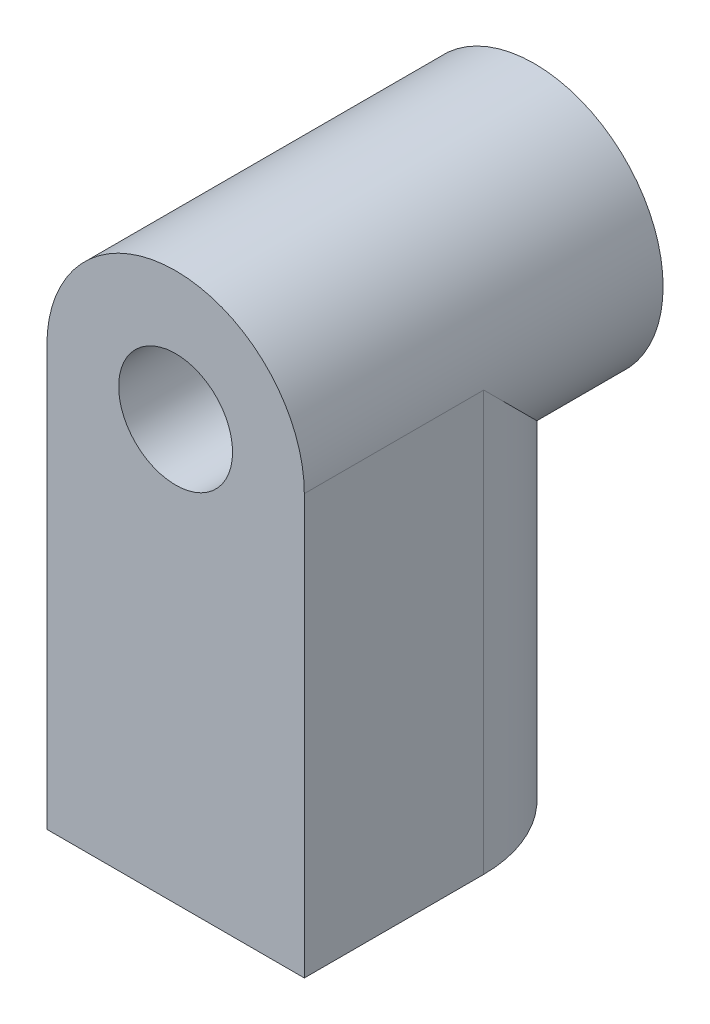
ISO-10303-21;
HEADER;
FILE_DESCRIPTION(('STEP AP214'),'2;1');
FILE_NAME('part.step','',(''),(''),'','','');
FILE_SCHEMA(('AUTOMOTIVE_DESIGN { 1 0 10303 214 1 1 1 1 }'));
ENDSEC;
DATA;
#1=APPLICATION_CONTEXT('core data for automotive mechanical design processes');
#2=APPLICATION_PROTOCOL_DEFINITION('international standard','automotive_design',2000,#1);
#3=PRODUCT_CONTEXT('',#1,'mechanical');
#4=PRODUCT('Part','Part','',(#3));
#5=PRODUCT_RELATED_PRODUCT_CATEGORY('part','',(#4));
#6=PRODUCT_DEFINITION_FORMATION('','',#4);
#7=PRODUCT_DEFINITION_CONTEXT('part definition',#1,'design');
#8=PRODUCT_DEFINITION('design','',#6,#7);
#9=PRODUCT_DEFINITION_SHAPE('','',#8);
#10=(LENGTH_UNIT() NAMED_UNIT(*) SI_UNIT(.MILLI.,.METRE.));
#11=(NAMED_UNIT(*) PLANE_ANGLE_UNIT() SI_UNIT($,.RADIAN.));
#12=(NAMED_UNIT(*) SI_UNIT($,.STERADIAN.) SOLID_ANGLE_UNIT());
#13=UNCERTAINTY_MEASURE_WITH_UNIT(LENGTH_MEASURE(1.E-05),#10,'distance_accuracy_value','');
#14=(GEOMETRIC_REPRESENTATION_CONTEXT(3) GLOBAL_UNCERTAINTY_ASSIGNED_CONTEXT((#13)) GLOBAL_UNIT_ASSIGNED_CONTEXT((#10,
#11,#12)) REPRESENTATION_CONTEXT('',''));
#15=CARTESIAN_POINT('',(0.,0.,0.));
#16=DIRECTION('',(0.,0.,1.));
#17=DIRECTION('',(1.,0.,0.));
#18=AXIS2_PLACEMENT_3D('',#15,#16,#17);
#19=CARTESIAN_POINT('',(0.,0.,10.));
#20=DIRECTION('',(0.,0.,-1.));
#21=DIRECTION('',(-1.,0.,0.));
#22=AXIS2_PLACEMENT_3D('',#19,#20,#21);
#23=CYLINDRICAL_SURFACE('',#22,3.5875);
#24=CARTESIAN_POINT('',(0.,0.,0.));
#25=DIRECTION('',(0.,0.,1.));
#26=DIRECTION('',(1.,0.,0.));
#27=AXIS2_PLACEMENT_3D('',#24,#25,#26);
#28=CIRCLE('',#27,3.5875);
#29=CARTESIAN_POINT('',(3.5875,0.,0.));
#30=VERTEX_POINT('',#29);
#31=EDGE_CURVE('E109',#30,#30,#28,.T.);
#32=ORIENTED_EDGE('',*,*,#31,.T.);
#33=EDGE_LOOP('',(#32));
#34=FACE_BOUND('',#33,.T.);
#35=DIRECTION('',(0.,0.,-1.));
#36=VECTOR('',#35,1.);
#37=CARTESIAN_POINT('',(3.5875,0.,10.));
#38=LINE('',#37,#36);
#39=CARTESIAN_POINT('',(3.5875,0.,5.00000000000002));
#40=VERTEX_POINT('',#39);
#41=CARTESIAN_POINT('',(3.5875,0.,10.));
#42=VERTEX_POINT('',#41);
#43=EDGE_CURVE('E237',#40,#42,#38,.F.);
#44=ORIENTED_EDGE('',*,*,#43,.F.);
#45=CARTESIAN_POINT('',(0.,0.,5.));
#46=DIRECTION('',(0.,0.707106781186547,-0.707106781186547));
#47=DIRECTION('',(0.,-0.707106781186547,-0.707106781186547));
#48=AXIS2_PLACEMENT_3D('',#45,#46,#47);
#49=ELLIPSE('',#48,5.07349115501348,3.5875);
#50=CARTESIAN_POINT('',(-3.5875,0.,5.00000000000002));
#51=VERTEX_POINT('',#50);
#52=EDGE_CURVE('E11',#40,#51,#49,.T.);
#53=ORIENTED_EDGE('',*,*,#52,.T.);
#54=DIRECTION('',(0.,0.,-1.));
#55=VECTOR('',#54,1.);
#56=CARTESIAN_POINT('',(-3.5875,0.,10.));
#57=LINE('',#56,#55);
#58=CARTESIAN_POINT('',(-3.5875,0.,10.));
#59=VERTEX_POINT('',#58);
#60=EDGE_CURVE('E78',#51,#59,#57,.F.);
#61=ORIENTED_EDGE('',*,*,#60,.T.);
#62=CARTESIAN_POINT('',(0.,0.,10.));
#63=DIRECTION('',(0.,0.,1.));
#64=DIRECTION('',(1.,0.,0.));
#65=AXIS2_PLACEMENT_3D('',#62,#63,#64);
#66=CIRCLE('',#65,3.5875);
#67=EDGE_CURVE('E112',#42,#59,#66,.T.);
#68=ORIENTED_EDGE('',*,*,#67,.F.);
#69=EDGE_LOOP('',(#44,#53,#61,#68));
#70=FACE_BOUND('',#69,.T.);
#71=ADVANCED_FACE('F33',(#34,#70),#23,.T.);
#72=CARTESIAN_POINT('',(0.,0.,10.));
#73=DIRECTION('',(0.,0.,1.));
#74=DIRECTION('',(1.,0.,0.));
#75=AXIS2_PLACEMENT_3D('',#72,#73,#74);
#76=PLANE('',#75);
#77=DIRECTION('',(0.,1.,0.));
#78=VECTOR('',#77,1.);
#79=CARTESIAN_POINT('',(3.5875,-11.69195383,10.));
#80=LINE('',#79,#78);
#81=CARTESIAN_POINT('',(3.5875,-11.69195383,10.));
#82=VERTEX_POINT('',#81);
#83=EDGE_CURVE('E54',#82,#42,#80,.T.);
#84=ORIENTED_EDGE('',*,*,#83,.T.);
#85=ORIENTED_EDGE('',*,*,#67,.T.);
#86=DIRECTION('',(0.,1.,0.));
#87=VECTOR('',#86,1.);
#88=CARTESIAN_POINT('',(-3.5875,-11.69195383,10.));
#89=LINE('',#88,#87);
#90=CARTESIAN_POINT('',(-3.5875,-11.69195383,10.));
#91=VERTEX_POINT('',#90);
#92=EDGE_CURVE('E80',#91,#59,#89,.T.);
#93=ORIENTED_EDGE('',*,*,#92,.F.);
#94=DIRECTION('',(1.,0.,0.));
#95=VECTOR('',#94,1.);
#96=CARTESIAN_POINT('',(-3.5875,-11.69195383,10.));
#97=LINE('',#96,#95);
#98=EDGE_CURVE('E90',#91,#82,#97,.T.);
#99=ORIENTED_EDGE('',*,*,#98,.T.);
#100=EDGE_LOOP('',(#84,#85,#93,#99));
#101=FACE_BOUND('',#100,.T.);
#102=CARTESIAN_POINT('',(0.,0.,10.));
#103=DIRECTION('',(0.,0.,1.));
#104=DIRECTION('',(1.,0.,0.));
#105=AXIS2_PLACEMENT_3D('',#102,#103,#104);
#106=CIRCLE('',#105,1.5875);
#107=CARTESIAN_POINT('',(1.5875,0.,10.));
#108=VERTEX_POINT('',#107);
#109=EDGE_CURVE('E106',#108,#108,#106,.T.);
#110=ORIENTED_EDGE('',*,*,#109,.F.);
#111=EDGE_LOOP('',(#110));
#112=FACE_BOUND('',#111,.T.);
#113=ADVANCED_FACE('F141',(#101,#112),#76,.T.);
#114=CARTESIAN_POINT('',(0.,0.,0.));
#115=DIRECTION('',(0.,0.,1.));
#116=DIRECTION('',(1.,0.,0.));
#117=AXIS2_PLACEMENT_3D('',#114,#115,#116);
#118=PLANE('',#117);
#119=ORIENTED_EDGE('',*,*,#31,.F.);
#120=EDGE_LOOP('',(#119));
#121=FACE_BOUND('',#120,.T.);
#122=CARTESIAN_POINT('',(0.,0.,0.));
#123=DIRECTION('',(0.,0.,1.));
#124=DIRECTION('',(1.,0.,0.));
#125=AXIS2_PLACEMENT_3D('',#122,#123,#124);
#126=CIRCLE('',#125,1.5875);
#127=CARTESIAN_POINT('',(1.5875,0.,0.));
#128=VERTEX_POINT('',#127);
#129=EDGE_CURVE('E103',#128,#128,#126,.T.);
#130=ORIENTED_EDGE('',*,*,#129,.T.);
#131=EDGE_LOOP('',(#130));
#132=FACE_BOUND('',#131,.T.);
#133=ADVANCED_FACE('F139',(#121,#132),#118,.F.);
#134=CARTESIAN_POINT('',(0.,0.,10.));
#135=DIRECTION('',(0.,0.,-1.));
#136=DIRECTION('',(-1.,0.,0.));
#137=AXIS2_PLACEMENT_3D('',#134,#135,#136);
#138=CYLINDRICAL_SURFACE('',#137,1.5875);
#139=ORIENTED_EDGE('',*,*,#109,.T.);
#140=EDGE_LOOP('',(#139));
#141=FACE_BOUND('',#140,.T.);
#142=ORIENTED_EDGE('',*,*,#129,.F.);
#143=EDGE_LOOP('',(#142));
#144=FACE_BOUND('',#143,.T.);
#145=ADVANCED_FACE('F136',(#141,#144),#138,.F.);
#146=CARTESIAN_POINT('',(0.,-11.69195383,5.));
#147=DIRECTION('',(0.,1.,0.));
#148=DIRECTION('',(0.,0.,1.));
#149=AXIS2_PLACEMENT_3D('',#146,#147,#148);
#150=CYLINDRICAL_SURFACE('',#149,3.5875);
#151=ORIENTED_EDGE('',*,*,#52,.F.);
#152=DIRECTION('',(0.,1.,0.));
#153=VECTOR('',#152,1.);
#154=CARTESIAN_POINT('',(3.5875,-11.69195383,5.));
#155=LINE('',#154,#153);
#156=CARTESIAN_POINT('',(3.5875,-11.69195383,5.));
#157=VERTEX_POINT('',#156);
#158=EDGE_CURVE('E93',#157,#40,#155,.T.);
#159=ORIENTED_EDGE('',*,*,#158,.F.);
#160=CARTESIAN_POINT('',(0.,-11.69195383,5.));
#161=DIRECTION('',(0.,1.,0.));
#162=DIRECTION('',(0.,0.,1.));
#163=AXIS2_PLACEMENT_3D('',#160,#161,#162);
#164=CIRCLE('',#163,3.5875);
#165=CARTESIAN_POINT('',(-3.5875,-11.69195383,5.));
#166=VERTEX_POINT('',#165);
#167=EDGE_CURVE('E88',#157,#166,#164,.T.);
#168=ORIENTED_EDGE('',*,*,#167,.T.);
#169=DIRECTION('',(0.,1.,0.));
#170=VECTOR('',#169,1.);
#171=CARTESIAN_POINT('',(-3.5875,-11.69195383,5.));
#172=LINE('',#171,#170);
#173=EDGE_CURVE('E72',#166,#51,#172,.T.);
#174=ORIENTED_EDGE('',*,*,#173,.T.);
#175=EDGE_LOOP('',(#151,#159,#168,#174));
#176=FACE_BOUND('',#175,.T.);
#177=ADVANCED_FACE('F92',(#176),#150,.T.);
#178=CARTESIAN_POINT('',(0.,-11.69195383,5.));
#179=DIRECTION('',(0.,1.,0.));
#180=DIRECTION('',(0.,0.,1.));
#181=AXIS2_PLACEMENT_3D('',#178,#179,#180);
#182=CYLINDRICAL_SURFACE('',#181,1.5875);
#183=CARTESIAN_POINT('',(0.,-11.69195383,5.));
#184=DIRECTION('',(0.,1.,0.));
#185=DIRECTION('',(0.,0.,1.));
#186=AXIS2_PLACEMENT_3D('',#183,#184,#185);
#187=CIRCLE('',#186,1.5875);
#188=CARTESIAN_POINT('',(0.,-11.69195383,6.5875));
#189=VERTEX_POINT('',#188);
#190=EDGE_CURVE('E94',#189,#189,#187,.T.);
#191=ORIENTED_EDGE('',*,*,#190,.F.);
#192=EDGE_LOOP('',(#191));
#193=FACE_BOUND('',#192,.T.);
#194=CARTESIAN_POINT('',(0.,-3.5875,6.5875));
#195=CARTESIAN_POINT('',(0.0845634876194858,-3.58749682124514,6.58749610695464));
#196=CARTESIAN_POINT('',(0.16926017802253,-3.58447659321789,6.58070338617058));
#197=CARTESIAN_POINT('',(0.336219018214407,-3.57269574861966,6.55380070610006));
#198=CARTESIAN_POINT('',(0.418474776850568,-3.56392125085705,6.53365854231408));
#199=CARTESIAN_POINT('',(0.577872365320636,-3.54156377493545,6.48095875949666));
#200=CARTESIAN_POINT('',(0.655031246643133,-3.52799790616164,6.44844528533548));
#201=CARTESIAN_POINT('',(0.802715068091962,-3.49735622571544,6.37212215383994));
#202=CARTESIAN_POINT('',(0.873241550011434,-3.4802812327421,6.32831513075063));
#203=CARTESIAN_POINT('',(1.0096700819078,-3.44324973082866,6.22810543700843));
#204=CARTESIAN_POINT('',(1.07515931388058,-3.42319130761414,6.1711788058576));
#205=CARTESIAN_POINT('',(1.19602444410152,-3.38286109791768,6.04745801529482));
#206=CARTESIAN_POINT('',(1.25139436595054,-3.36258919278069,5.98065806661416));
#207=CARTESIAN_POINT('',(1.3535890420657,-3.32282000738714,5.83447567488825));
#208=CARTESIAN_POINT('',(1.39974513062915,-3.30343309615515,5.75459249735395));
#209=CARTESIAN_POINT('',(1.47778167547548,-3.26927292681813,5.58722138464663));
#210=CARTESIAN_POINT('',(1.50967039705541,-3.25449699900704,5.49973788762382));
#211=CARTESIAN_POINT('',(1.55650847101399,-3.23234916859977,5.32439576226961));
#212=CARTESIAN_POINT('',(1.57225674799674,-3.22463035697632,5.23679620046886));
#213=CARTESIAN_POINT('',(1.58885153893714,-3.21648906326287,5.05988445874519));
#214=CARTESIAN_POINT('',(1.58970787281928,-3.21606177306035,4.97057344627918));
#215=CARTESIAN_POINT('',(1.57709073143585,-3.22226211773942,4.80123477953944));
#216=CARTESIAN_POINT('',(1.56487966324059,-3.22826828257653,4.72108548075376));
#217=CARTESIAN_POINT('',(1.52861230257668,-3.24559705997116,4.56411912290962));
#218=CARTESIAN_POINT('',(1.50455337832079,-3.25692085371796,4.48730280834048));
#219=CARTESIAN_POINT('',(1.44479662193881,-3.28387112970238,4.33712798613013));
#220=CARTESIAN_POINT('',(1.40885037546912,-3.29958822933585,4.26388532952286));
#221=CARTESIAN_POINT('',(1.3265177788148,-3.33353969479333,4.12416365835864));
#222=CARTESIAN_POINT('',(1.28012705009271,-3.35177511510502,4.0576874974742));
#223=CARTESIAN_POINT('',(1.17297848901267,-3.39084489476522,3.92663433081121));
#224=CARTESIAN_POINT('',(1.11126634684625,-3.41176025824693,3.86285932706402));
#225=CARTESIAN_POINT('',(0.977844975394819,-3.45236669883585,3.74627495436193));
#226=CARTESIAN_POINT('',(0.906132785786553,-3.47205741090327,3.69346884410534));
#227=CARTESIAN_POINT('',(0.75204287465785,-3.50870780957966,3.59893354536903));
#228=CARTESIAN_POINT('',(0.669415836937222,-3.52557154250363,3.55757070596873));
#229=CARTESIAN_POINT('',(0.497438258053332,-3.55391124567205,3.4896210480794));
#230=CARTESIAN_POINT('',(0.408091958092281,-3.56539058197632,3.46302499620557));
#231=CARTESIAN_POINT('',(0.231878742188825,-3.58101427937738,3.42713512397601));
#232=CARTESIAN_POINT('',(0.145270891588434,-3.58561286782575,3.41676751387249));
#233=CARTESIAN_POINT('',(-0.0285638614464689,-3.58843790390226,3.41037817598104));
#234=CARTESIAN_POINT('',(-0.115790546230041,-3.58666649084531,3.41435163186055));
#235=CARTESIAN_POINT('',(-0.283091390400667,-3.57723895503282,3.43580039771427));
#236=CARTESIAN_POINT('',(-0.363288473070755,-3.56992696184415,3.45248643846533));
#237=CARTESIAN_POINT('',(-0.519635732293143,-3.55054141103274,3.4977480216446));
#238=CARTESIAN_POINT('',(-0.595785414237287,-3.53846727296853,3.5263250134433));
#239=CARTESIAN_POINT('',(-0.744575134140348,-3.5102251090186,3.59546979563763));
#240=CARTESIAN_POINT('',(-0.817031401889903,-3.4939410498083,3.63638405658935));
#241=CARTESIAN_POINT('',(-0.954311306906491,-3.45896985247676,3.72866432837202));
#242=CARTESIAN_POINT('',(-1.01913160679502,-3.44028167101924,3.78003488267384));
#243=CARTESIAN_POINT('',(-1.14476298192068,-3.40064011949213,3.89655632860021));
#244=CARTESIAN_POINT('',(-1.20483903532192,-3.37962511018393,3.96248065664621));
#245=CARTESIAN_POINT('',(-1.31331953867703,-3.33896867194357,4.10374003902341));
#246=CARTESIAN_POINT('',(-1.36171996566771,-3.31932771810737,4.17907832350084));
#247=CARTESIAN_POINT('',(-1.44640932821618,-3.28332601467635,4.33935535797357));
#248=CARTESIAN_POINT('',(-1.48239734141947,-3.26705015303582,4.42447367099193));
#249=CARTESIAN_POINT('',(-1.53918876510195,-3.24068696254746,4.60051738774674));
#250=CARTESIAN_POINT('',(-1.56000686966903,-3.23059364659122,4.69143707895819));
#251=CARTESIAN_POINT('',(-1.58432370136478,-3.2187328184032,4.86825476817284));
#252=CARTESIAN_POINT('',(-1.58913381085818,-3.21633550354188,4.95393049538045));
#253=CARTESIAN_POINT('',(-1.58488885389601,-3.21842984750215,5.12484212348586));
#254=CARTESIAN_POINT('',(-1.57583667543104,-3.2229200714132,5.21007811228453));
#255=CARTESIAN_POINT('',(-1.54526918837158,-3.23767787169789,5.3724571855971));
#256=CARTESIAN_POINT('',(-1.52452248734903,-3.24758812771644,5.44978078618898));
#257=CARTESIAN_POINT('',(-1.47196156490347,-3.27174529858293,5.5998421589568));
#258=CARTESIAN_POINT('',(-1.44014415075952,-3.28599346430722,5.67257860107053));
#259=CARTESIAN_POINT('',(-1.36401993505521,-3.31834560864272,5.81648632161598));
#260=CARTESIAN_POINT('',(-1.31904543941557,-3.33663768415281,5.88726118147513));
#261=CARTESIAN_POINT('',(-1.21875579227653,-3.37456115857461,6.02066699139797));
#262=CARTESIAN_POINT('',(-1.16343636991302,-3.39419310851499,6.08329455971006));
#263=CARTESIAN_POINT('',(-1.03837480922315,-3.4346194566046,6.20421585472265));
#264=CARTESIAN_POINT('',(-0.967799493860647,-3.45536773321522,6.26166758890345));
#265=CARTESIAN_POINT('',(-0.817278533375574,-3.49402946609202,6.36399831378183));
#266=CARTESIAN_POINT('',(-0.737328639033696,-3.51194162811831,6.40887157153932));
#267=CARTESIAN_POINT('',(-0.571084034317277,-3.54275058863518,6.48399592976));
#268=CARTESIAN_POINT('',(-0.484874897916483,-3.55570383587957,6.51441261935929));
#269=CARTESIAN_POINT('',(-0.307988162493962,-3.57535453346465,6.55999682076643));
#270=CARTESIAN_POINT('',(-0.217325120999662,-3.58207110017763,6.57521094174234));
#271=CARTESIAN_POINT('',(-0.105109060654813,-3.58602220399079,6.58415731065376));
#272=CARTESIAN_POINT('',(-0.0841129745372234,-3.58657543693079,6.58540966337171));
#273=CARTESIAN_POINT('',(-0.0420806757086192,-3.58731473247066,6.58708149699965));
#274=CARTESIAN_POINT('',(-0.0210444625623267,-3.58750079106467,6.58750096882295));
#275=CARTESIAN_POINT('',(0.,-3.5875,6.5875));
#276=B_SPLINE_CURVE_WITH_KNOTS('',3,(#194,#195,#196,#197,#198,#199,#200,#201,#202,#203,#204,
#205,#206,#207,#208,#209,#210,#211,#212,#213,#214,#215,#216,#217,#218,#219,#220,#221,#222,#223,
#224,#225,#226,#227,#228,#229,#230,#231,#232,#233,#234,#235,#236,#237,#238,#239,#240,#241,#242,
#243,#244,#245,#246,#247,#248,#249,#250,#251,#252,#253,#254,#255,#256,#257,#258,#259,#260,#261,
#262,#263,#264,#265,#266,#267,#268,#269,#270,#271,#272,#273,#274,#275),.UNSPECIFIED.,.T.,.F.,(4,
2,2,2,2,2,2,2,2,2,2,2,2,2,2,2,2,2,2,2,2,2,2,2,2,2,2,2,2,2,2,2,2,2,2,2,2,2,2,2,4),(0.,
0.253603908232342,0.507821854122006,0.761141047768691,1.0144012075342,1.28043858470249,
1.54663257763415,1.82802997102349,2.10926413498514,2.37578519363949,2.64213049846713,
2.88488684871712,3.12769714724643,3.3759412148288,3.62428954575002,3.89659827892063,
4.16898779570584,4.44929025285937,4.7294172443904,4.99008055230578,5.25065632667623,
5.49625318723905,5.74187999201443,5.99517457943421,6.24857946433238,6.52224676352912,
6.79600822349274,7.07600417628648,7.35572855367277,7.61188629357116,7.86799067427554,
8.10895135617172,8.34998158722262,8.60640047274742,8.86292545449489,9.14161480926971,
9.4204309775872,9.69597158812908,9.9706648096693,10.0337759688432,10.0968878165531),.UNSPECIFIED.);
#277=CARTESIAN_POINT('',(0.,-3.5875,6.5875));
#278=VERTEX_POINT('',#277);
#279=EDGE_CURVE('E41',#278,#278,#276,.T.);
#280=ORIENTED_EDGE('',*,*,#279,.T.);
#281=EDGE_LOOP('',(#280));
#282=FACE_BOUND('',#281,.T.);
#283=ADVANCED_FACE('F119',(#193,#282),#182,.F.);
#284=CARTESIAN_POINT('',(3.5875,-11.69195383,10.));
#285=DIRECTION('',(1.,0.,0.));
#286=DIRECTION('',(0.,0.,-1.));
#287=AXIS2_PLACEMENT_3D('',#284,#285,#286);
#288=PLANE('',#287);
#289=ORIENTED_EDGE('',*,*,#158,.T.);
#290=ORIENTED_EDGE('',*,*,#43,.T.);
#291=ORIENTED_EDGE('',*,*,#83,.F.);
#292=DIRECTION('',(0.,0.,-1.));
#293=VECTOR('',#292,1.);
#294=CARTESIAN_POINT('',(3.5875,-11.69195383,10.));
#295=LINE('',#294,#293);
#296=EDGE_CURVE('E81',#82,#157,#295,.T.);
#297=ORIENTED_EDGE('',*,*,#296,.T.);
#298=EDGE_LOOP('',(#289,#290,#291,#297));
#299=FACE_BOUND('',#298,.T.);
#300=ADVANCED_FACE('F123',(#299),#288,.T.);
#301=CARTESIAN_POINT('',(-3.5875,-11.69195383,5.));
#302=DIRECTION('',(-1.,0.,0.));
#303=DIRECTION('',(0.,0.,1.));
#304=AXIS2_PLACEMENT_3D('',#301,#302,#303);
#305=PLANE('',#304);
#306=ORIENTED_EDGE('',*,*,#92,.T.);
#307=ORIENTED_EDGE('',*,*,#60,.F.);
#308=ORIENTED_EDGE('',*,*,#173,.F.);
#309=DIRECTION('',(0.,0.,1.));
#310=VECTOR('',#309,1.);
#311=CARTESIAN_POINT('',(-3.5875,-11.69195383,5.));
#312=LINE('',#311,#310);
#313=EDGE_CURVE('E76',#166,#91,#312,.T.);
#314=ORIENTED_EDGE('',*,*,#313,.T.);
#315=EDGE_LOOP('',(#306,#307,#308,#314));
#316=FACE_BOUND('',#315,.T.);
#317=ADVANCED_FACE('F75',(#316),#305,.T.);
#318=CARTESIAN_POINT('',(0.,-11.69195383,5.));
#319=DIRECTION('',(0.,1.,0.));
#320=DIRECTION('',(0.,0.,1.));
#321=AXIS2_PLACEMENT_3D('',#318,#319,#320);
#322=PLANE('',#321);
#323=ORIENTED_EDGE('',*,*,#190,.T.);
#324=EDGE_LOOP('',(#323));
#325=FACE_BOUND('',#324,.T.);
#326=ORIENTED_EDGE('',*,*,#167,.F.);
#327=ORIENTED_EDGE('',*,*,#296,.F.);
#328=ORIENTED_EDGE('',*,*,#98,.F.);
#329=ORIENTED_EDGE('',*,*,#313,.F.);
#330=EDGE_LOOP('',(#326,#327,#328,#329));
#331=FACE_BOUND('',#330,.T.);
#332=ADVANCED_FACE('F86',(#325,#331),#322,.F.);
#333=ORIENTED_EDGE('',*,*,#279,.F.);
#334=EDGE_LOOP('',(#333));
#335=FACE_BOUND('',#334,.T.);
#336=ADVANCED_FACE('F127',(#335),#23,.T.);
#337=CLOSED_SHELL('',(#71,#113,#133,#145,#177,#283,#300,#317,#332,#336));
#338=MANIFOLD_SOLID_BREP('B2',#337);
#339=ADVANCED_BREP_SHAPE_REPRESENTATION('',(#18,#338),#14);
#340=SHAPE_DEFINITION_REPRESENTATION(#9,#339);
ENDSEC;
END-ISO-10303-21;
